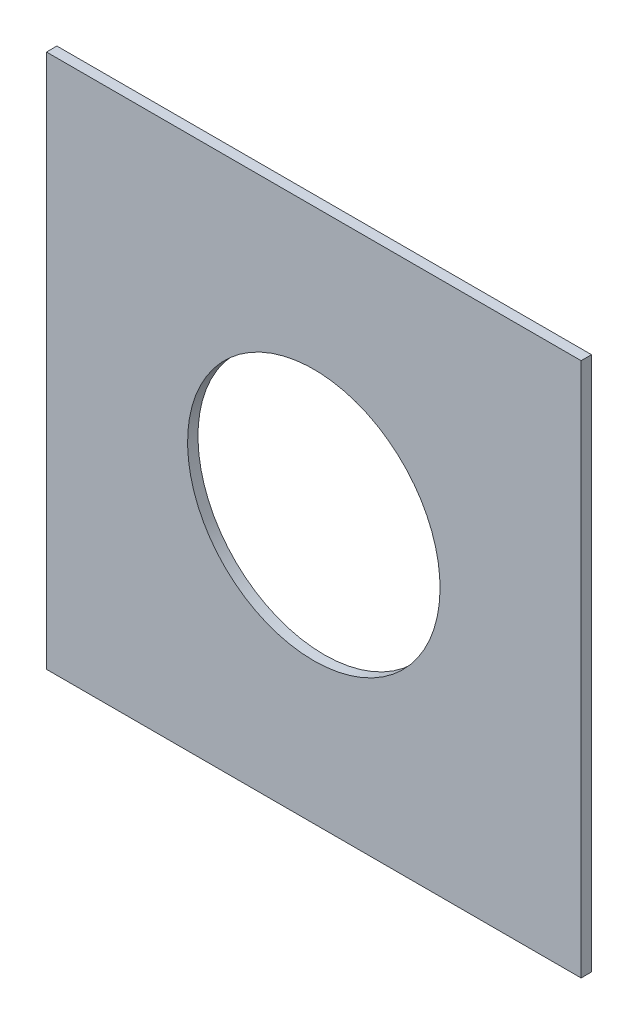
ISO-10303-21;
HEADER;
FILE_DESCRIPTION(('STEP AP214'),'2;1');
FILE_NAME('part.step','',(''),(''),'','','');
FILE_SCHEMA(('AUTOMOTIVE_DESIGN { 1 0 10303 214 1 1 1 1 }'));
ENDSEC;
DATA;
#1=APPLICATION_CONTEXT('core data for automotive mechanical design processes');
#2=APPLICATION_PROTOCOL_DEFINITION('international standard','automotive_design',2000,#1);
#3=PRODUCT_CONTEXT('',#1,'mechanical');
#4=PRODUCT('Part','Part','',(#3));
#5=PRODUCT_RELATED_PRODUCT_CATEGORY('part','',(#4));
#6=PRODUCT_DEFINITION_FORMATION('','',#4);
#7=PRODUCT_DEFINITION_CONTEXT('part definition',#1,'design');
#8=PRODUCT_DEFINITION('design','',#6,#7);
#9=PRODUCT_DEFINITION_SHAPE('','',#8);
#10=(LENGTH_UNIT() NAMED_UNIT(*) SI_UNIT(.MILLI.,.METRE.));
#11=(NAMED_UNIT(*) PLANE_ANGLE_UNIT() SI_UNIT($,.RADIAN.));
#12=(NAMED_UNIT(*) SI_UNIT($,.STERADIAN.) SOLID_ANGLE_UNIT());
#13=UNCERTAINTY_MEASURE_WITH_UNIT(LENGTH_MEASURE(1.E-05),#10,'distance_accuracy_value','');
#14=(GEOMETRIC_REPRESENTATION_CONTEXT(3) GLOBAL_UNCERTAINTY_ASSIGNED_CONTEXT((#13)) GLOBAL_UNIT_ASSIGNED_CONTEXT((#10,
#11,#12)) REPRESENTATION_CONTEXT('',''));
#15=CARTESIAN_POINT('',(0.,0.,0.));
#16=DIRECTION('',(0.,0.,1.));
#17=DIRECTION('',(1.,0.,0.));
#18=AXIS2_PLACEMENT_3D('',#15,#16,#17);
#19=CARTESIAN_POINT('',(119.6898,-71.2108,-0.045));
#20=DIRECTION('',(0.,0.,-1.));
#21=DIRECTION('',(0.,-1.,0.));
#22=AXIS2_PLACEMENT_3D('',#19,#20,#21);
#23=CYLINDRICAL_SURFACE('',#22,0.425);
#24=CARTESIAN_POINT('',(119.6898,-71.2108,-0.035));
#25=DIRECTION('',(0.,0.,-1.));
#26=DIRECTION('',(0.,-1.,0.));
#27=AXIS2_PLACEMENT_3D('',#24,#25,#26);
#28=CIRCLE('',#27,0.425);
#29=CARTESIAN_POINT('',(119.6898,-71.6358,-0.035));
#30=VERTEX_POINT('',#29);
#31=EDGE_CURVE('E82',#30,#30,#28,.T.);
#32=ORIENTED_EDGE('',*,*,#31,.T.);
#33=DIRECTION('',(0.,0.,1.));
#34=VECTOR('',#33,1.);
#35=CARTESIAN_POINT('',(119.6898,-71.6358,-0.045));
#36=LINE('',#35,#34);
#37=CARTESIAN_POINT('',(119.6898,-71.6358,0.));
#38=VERTEX_POINT('',#37);
#39=EDGE_CURVE('E11',#30,#38,#36,.T.);
#40=ORIENTED_EDGE('',*,*,#39,.T.);
#41=CARTESIAN_POINT('',(119.6898,-71.2108,0.));
#42=DIRECTION('',(0.,0.,-1.));
#43=DIRECTION('',(0.,-1.,0.));
#44=AXIS2_PLACEMENT_3D('',#41,#42,#43);
#45=CIRCLE('',#44,0.425);
#46=EDGE_CURVE('E26',#38,#38,#45,.T.);
#47=ORIENTED_EDGE('',*,*,#46,.F.);
#48=ORIENTED_EDGE('',*,*,#39,.F.);
#49=EDGE_LOOP('',(#32,#40,#47,#48));
#50=FACE_BOUND('',#49,.T.);
#51=ADVANCED_FACE('F17',(#50),#23,.F.);
#52=CARTESIAN_POINT('',(118.7898,-70.3108,-0.035));
#53=DIRECTION('',(0.,1.,0.));
#54=DIRECTION('',(1.,0.,0.));
#55=AXIS2_PLACEMENT_3D('',#52,#53,#54);
#56=PLANE('',#55);
#57=DIRECTION('',(0.,0.,1.));
#58=VECTOR('',#57,1.);
#59=CARTESIAN_POINT('',(118.7898,-70.3108,-0.035));
#60=LINE('',#59,#58);
#61=CARTESIAN_POINT('',(118.7898,-70.3108,-0.035));
#62=VERTEX_POINT('',#61);
#63=CARTESIAN_POINT('',(118.7898,-70.3108,0.));
#64=VERTEX_POINT('',#63);
#65=EDGE_CURVE('E74',#62,#64,#60,.T.);
#66=ORIENTED_EDGE('',*,*,#65,.T.);
#67=DIRECTION('',(1.,0.,0.));
#68=VECTOR('',#67,1.);
#69=CARTESIAN_POINT('',(118.7898,-70.3108,0.));
#70=LINE('',#69,#68);
#71=CARTESIAN_POINT('',(120.5898,-70.3108,0.));
#72=VERTEX_POINT('',#71);
#73=EDGE_CURVE('E63',#64,#72,#70,.T.);
#74=ORIENTED_EDGE('',*,*,#73,.T.);
#75=DIRECTION('',(0.,0.,1.));
#76=VECTOR('',#75,1.);
#77=CARTESIAN_POINT('',(120.5898,-70.3108,-0.035));
#78=LINE('',#77,#76);
#79=CARTESIAN_POINT('',(120.5898,-70.3108,-0.035));
#80=VERTEX_POINT('',#79);
#81=EDGE_CURVE('E77',#80,#72,#78,.T.);
#82=ORIENTED_EDGE('',*,*,#81,.F.);
#83=DIRECTION('',(1.,0.,0.));
#84=VECTOR('',#83,1.);
#85=CARTESIAN_POINT('',(118.7898,-70.3108,-0.035));
#86=LINE('',#85,#84);
#87=EDGE_CURVE('E70',#62,#80,#86,.T.);
#88=ORIENTED_EDGE('',*,*,#87,.F.);
#89=EDGE_LOOP('',(#66,#74,#82,#88));
#90=FACE_BOUND('',#89,.T.);
#91=ADVANCED_FACE('F72',(#90),#56,.T.);
#92=CARTESIAN_POINT('',(0.,0.,0.));
#93=DIRECTION('',(0.,0.,1.));
#94=DIRECTION('',(1.,0.,0.));
#95=AXIS2_PLACEMENT_3D('',#92,#93,#94);
#96=PLANE('',#95);
#97=ORIENTED_EDGE('',*,*,#46,.T.);
#98=EDGE_LOOP('',(#97));
#99=FACE_BOUND('',#98,.T.);
#100=DIRECTION('',(-1.,0.,0.));
#101=VECTOR('',#100,1.);
#102=CARTESIAN_POINT('',(120.5898,-72.1108,0.));
#103=LINE('',#102,#101);
#104=CARTESIAN_POINT('',(120.5898,-72.1108,0.));
#105=VERTEX_POINT('',#104);
#106=CARTESIAN_POINT('',(118.7898,-72.1108,0.));
#107=VERTEX_POINT('',#106);
#108=EDGE_CURVE('E128',#105,#107,#103,.T.);
#109=ORIENTED_EDGE('',*,*,#108,.F.);
#110=DIRECTION('',(0.,-1.,0.));
#111=VECTOR('',#110,1.);
#112=CARTESIAN_POINT('',(120.5898,-70.3108,0.));
#113=LINE('',#112,#111);
#114=EDGE_CURVE('E117',#72,#105,#113,.T.);
#115=ORIENTED_EDGE('',*,*,#114,.F.);
#116=ORIENTED_EDGE('',*,*,#73,.F.);
#117=DIRECTION('',(0.,1.,0.));
#118=VECTOR('',#117,1.);
#119=CARTESIAN_POINT('',(118.7898,-72.1108,0.));
#120=LINE('',#119,#118);
#121=EDGE_CURVE('E95',#107,#64,#120,.T.);
#122=ORIENTED_EDGE('',*,*,#121,.F.);
#123=EDGE_LOOP('',(#109,#115,#116,#122));
#124=FACE_BOUND('',#123,.T.);
#125=ADVANCED_FACE('F142',(#99,#124),#96,.T.);
#126=CARTESIAN_POINT('',(0.,0.,-0.035));
#127=DIRECTION('',(0.,0.,1.));
#128=DIRECTION('',(1.,0.,0.));
#129=AXIS2_PLACEMENT_3D('',#126,#127,#128);
#130=PLANE('',#129);
#131=ORIENTED_EDGE('',*,*,#31,.F.);
#132=EDGE_LOOP('',(#131));
#133=FACE_BOUND('',#132,.T.);
#134=DIRECTION('',(0.,1.,0.));
#135=VECTOR('',#134,1.);
#136=CARTESIAN_POINT('',(118.7898,-72.1108,-0.035));
#137=LINE('',#136,#135);
#138=CARTESIAN_POINT('',(118.7898,-72.1108,-0.035));
#139=VERTEX_POINT('',#138);
#140=EDGE_CURVE('E83',#139,#62,#137,.T.);
#141=ORIENTED_EDGE('',*,*,#140,.T.);
#142=ORIENTED_EDGE('',*,*,#87,.T.);
#143=DIRECTION('',(0.,-1.,0.));
#144=VECTOR('',#143,1.);
#145=CARTESIAN_POINT('',(120.5898,-70.3108,-0.035));
#146=LINE('',#145,#144);
#147=CARTESIAN_POINT('',(120.5898,-72.1108,-0.035));
#148=VERTEX_POINT('',#147);
#149=EDGE_CURVE('E102',#80,#148,#146,.T.);
#150=ORIENTED_EDGE('',*,*,#149,.T.);
#151=DIRECTION('',(-1.,0.,0.));
#152=VECTOR('',#151,1.);
#153=CARTESIAN_POINT('',(120.5898,-72.1108,-0.035));
#154=LINE('',#153,#152);
#155=EDGE_CURVE('E88',#148,#139,#154,.T.);
#156=ORIENTED_EDGE('',*,*,#155,.T.);
#157=EDGE_LOOP('',(#141,#142,#150,#156));
#158=FACE_BOUND('',#157,.T.);
#159=ADVANCED_FACE('F86',(#133,#158),#130,.F.);
#160=CARTESIAN_POINT('',(118.7898,-72.1108,-0.035));
#161=DIRECTION('',(-1.,0.,0.));
#162=DIRECTION('',(0.,0.,1.));
#163=AXIS2_PLACEMENT_3D('',#160,#161,#162);
#164=PLANE('',#163);
#165=DIRECTION('',(0.,0.,1.));
#166=VECTOR('',#165,1.);
#167=CARTESIAN_POINT('',(118.7898,-72.1108,-0.035));
#168=LINE('',#167,#166);
#169=EDGE_CURVE('E125',#139,#107,#168,.T.);
#170=ORIENTED_EDGE('',*,*,#169,.T.);
#171=ORIENTED_EDGE('',*,*,#121,.T.);
#172=ORIENTED_EDGE('',*,*,#65,.F.);
#173=ORIENTED_EDGE('',*,*,#140,.F.);
#174=EDGE_LOOP('',(#170,#171,#172,#173));
#175=FACE_BOUND('',#174,.T.);
#176=ADVANCED_FACE('F94',(#175),#164,.T.);
#177=CARTESIAN_POINT('',(120.5898,-70.3108,-0.035));
#178=DIRECTION('',(1.,0.,0.));
#179=DIRECTION('',(0.,1.,0.));
#180=AXIS2_PLACEMENT_3D('',#177,#178,#179);
#181=PLANE('',#180);
#182=ORIENTED_EDGE('',*,*,#81,.T.);
#183=ORIENTED_EDGE('',*,*,#114,.T.);
#184=DIRECTION('',(0.,0.,1.));
#185=VECTOR('',#184,1.);
#186=CARTESIAN_POINT('',(120.5898,-72.1108,-0.035));
#187=LINE('',#186,#185);
#188=EDGE_CURVE('E129',#148,#105,#187,.T.);
#189=ORIENTED_EDGE('',*,*,#188,.F.);
#190=ORIENTED_EDGE('',*,*,#149,.F.);
#191=EDGE_LOOP('',(#182,#183,#189,#190));
#192=FACE_BOUND('',#191,.T.);
#193=ADVANCED_FACE('F151',(#192),#181,.T.);
#194=CARTESIAN_POINT('',(120.5898,-72.1108,-0.035));
#195=DIRECTION('',(0.,-1.,0.));
#196=DIRECTION('',(0.,0.,-1.));
#197=AXIS2_PLACEMENT_3D('',#194,#195,#196);
#198=PLANE('',#197);
#199=ORIENTED_EDGE('',*,*,#188,.T.);
#200=ORIENTED_EDGE('',*,*,#108,.T.);
#201=ORIENTED_EDGE('',*,*,#169,.F.);
#202=ORIENTED_EDGE('',*,*,#155,.F.);
#203=EDGE_LOOP('',(#199,#200,#201,#202));
#204=FACE_BOUND('',#203,.T.);
#205=ADVANCED_FACE('F139',(#204),#198,.T.);
#206=CLOSED_SHELL('',(#51,#91,#125,#159,#176,#193,#205));
#207=MANIFOLD_SOLID_BREP('B1',#206);
#208=ADVANCED_BREP_SHAPE_REPRESENTATION('',(#18,#207),#14);
#209=SHAPE_DEFINITION_REPRESENTATION(#9,#208);
ENDSEC;
END-ISO-10303-21;
